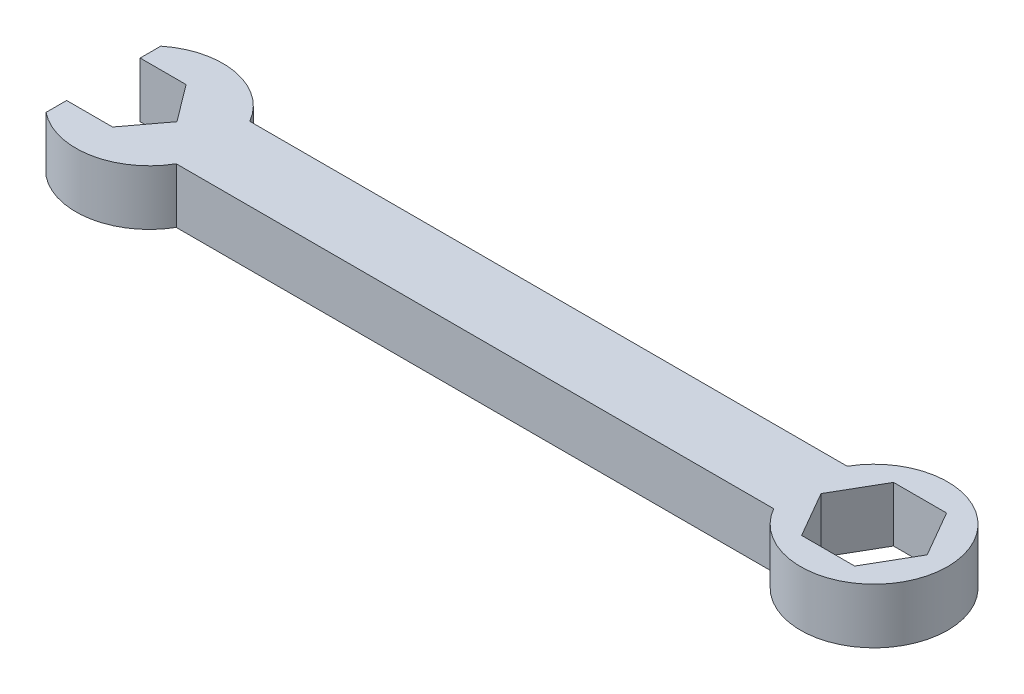
ISO-10303-21;
HEADER;
FILE_DESCRIPTION(('STEP AP214'),'2;1');
FILE_NAME('part.step','',(''),(''),'','','');
FILE_SCHEMA(('AUTOMOTIVE_DESIGN { 1 0 10303 214 1 1 1 1 }'));
ENDSEC;
DATA;
#1=APPLICATION_CONTEXT('core data for automotive mechanical design processes');
#2=APPLICATION_PROTOCOL_DEFINITION('international standard','automotive_design',2000,#1);
#3=PRODUCT_CONTEXT('',#1,'mechanical');
#4=PRODUCT('Part','Part','',(#3));
#5=PRODUCT_RELATED_PRODUCT_CATEGORY('part','',(#4));
#6=PRODUCT_DEFINITION_FORMATION('','',#4);
#7=PRODUCT_DEFINITION_CONTEXT('part definition',#1,'design');
#8=PRODUCT_DEFINITION('design','',#6,#7);
#9=PRODUCT_DEFINITION_SHAPE('','',#8);
#10=(LENGTH_UNIT() NAMED_UNIT(*) SI_UNIT(.MILLI.,.METRE.));
#11=(NAMED_UNIT(*) PLANE_ANGLE_UNIT() SI_UNIT($,.RADIAN.));
#12=(NAMED_UNIT(*) SI_UNIT($,.STERADIAN.) SOLID_ANGLE_UNIT());
#13=UNCERTAINTY_MEASURE_WITH_UNIT(LENGTH_MEASURE(1.E-05),#10,'distance_accuracy_value','');
#14=(GEOMETRIC_REPRESENTATION_CONTEXT(3) GLOBAL_UNCERTAINTY_ASSIGNED_CONTEXT((#13)) GLOBAL_UNIT_ASSIGNED_CONTEXT((#10,
#11,#12)) REPRESENTATION_CONTEXT('',''));
#15=CARTESIAN_POINT('',(0.,0.,0.));
#16=DIRECTION('',(0.,0.,1.));
#17=DIRECTION('',(1.,0.,0.));
#18=AXIS2_PLACEMENT_3D('',#15,#16,#17);
#19=CARTESIAN_POINT('',(0.,7.62,-5.08));
#20=DIRECTION('',(0.,0.,-1.));
#21=DIRECTION('',(-1.,0.,0.));
#22=AXIS2_PLACEMENT_3D('',#19,#20,#21);
#23=PLANE('',#22);
#24=DIRECTION('',(1.,0.,0.));
#25=VECTOR('',#24,1.);
#26=CARTESIAN_POINT('',(0.,0.,-5.08));
#27=LINE('',#26,#25);
#28=CARTESIAN_POINT('',(-41.275,0.,-5.08));
#29=VERTEX_POINT('',#28);
#30=CARTESIAN_POINT('',(41.275,0.,-5.08));
#31=VERTEX_POINT('',#30);
#32=EDGE_CURVE('E283',#29,#31,#27,.T.);
#33=ORIENTED_EDGE('',*,*,#32,.F.);
#34=DIRECTION('',(0.,-1.,0.));
#35=VECTOR('',#34,1.);
#36=CARTESIAN_POINT('',(-41.275,7.62,-5.08));
#37=LINE('',#36,#35);
#38=CARTESIAN_POINT('',(-41.275,7.62,-5.08));
#39=VERTEX_POINT('',#38);
#40=EDGE_CURVE('E11',#39,#29,#37,.T.);
#41=ORIENTED_EDGE('',*,*,#40,.F.);
#42=DIRECTION('',(1.,0.,0.));
#43=VECTOR('',#42,1.);
#44=CARTESIAN_POINT('',(0.,7.62,-5.08));
#45=LINE('',#44,#43);
#46=CARTESIAN_POINT('',(41.275,7.62,-5.08));
#47=VERTEX_POINT('',#46);
#48=EDGE_CURVE('E335',#39,#47,#45,.T.);
#49=ORIENTED_EDGE('',*,*,#48,.T.);
#50=DIRECTION('',(0.,-1.,0.));
#51=VECTOR('',#50,1.);
#52=CARTESIAN_POINT('',(41.275,7.62,-5.08));
#53=LINE('',#52,#51);
#54=EDGE_CURVE('E126',#47,#31,#53,.T.);
#55=ORIENTED_EDGE('',*,*,#54,.T.);
#56=EDGE_LOOP('',(#33,#41,#49,#55));
#57=FACE_BOUND('',#56,.T.);
#58=ADVANCED_FACE('F45',(#57),#23,.T.);
#59=CARTESIAN_POINT('',(-50.0738181024499,7.62,0.));
#60=DIRECTION('',(0.,-1.,0.));
#61=DIRECTION('',(0.,0.,-1.));
#62=AXIS2_PLACEMENT_3D('',#59,#60,#61);
#63=CYLINDRICAL_SURFACE('',#62,10.16);
#64=CARTESIAN_POINT('',(-50.0738181024499,0.,0.));
#65=DIRECTION('',(0.,1.,0.));
#66=DIRECTION('',(0.,0.,1.));
#67=AXIS2_PLACEMENT_3D('',#64,#65,#66);
#68=CIRCLE('',#67,10.16);
#69=CARTESIAN_POINT('',(-56.4238181024499,0.,-7.93114745796597));
#70=VERTEX_POINT('',#69);
#71=EDGE_CURVE('E279',#29,#70,#68,.T.);
#72=ORIENTED_EDGE('',*,*,#71,.T.);
#73=DIRECTION('',(0.,-1.,0.));
#74=VECTOR('',#73,1.);
#75=CARTESIAN_POINT('',(-56.4238181024499,7.62,-7.93114745796597));
#76=LINE('',#75,#74);
#77=CARTESIAN_POINT('',(-56.4238181024499,7.62,-7.93114745796597));
#78=VERTEX_POINT('',#77);
#79=EDGE_CURVE('E56',#78,#70,#76,.T.);
#80=ORIENTED_EDGE('',*,*,#79,.F.);
#81=CARTESIAN_POINT('',(-50.0738181024499,7.62,0.));
#82=DIRECTION('',(0.,1.,0.));
#83=DIRECTION('',(0.,0.,1.));
#84=AXIS2_PLACEMENT_3D('',#81,#82,#83);
#85=CIRCLE('',#84,10.16);
#86=EDGE_CURVE('E332',#39,#78,#85,.T.);
#87=ORIENTED_EDGE('',*,*,#86,.F.);
#88=ORIENTED_EDGE('',*,*,#40,.T.);
#89=EDGE_LOOP('',(#72,#80,#87,#88));
#90=FACE_BOUND('',#89,.T.);
#91=ADVANCED_FACE('F386',(#90),#63,.T.);
#92=CARTESIAN_POINT('',(-56.4238181024499,7.62,0.));
#93=DIRECTION('',(-1.,0.,0.));
#94=DIRECTION('',(0.,0.,1.));
#95=AXIS2_PLACEMENT_3D('',#92,#93,#94);
#96=PLANE('',#95);
#97=DIRECTION('',(0.,0.,-1.));
#98=VECTOR('',#97,1.);
#99=CARTESIAN_POINT('',(-56.4238181024499,0.,0.));
#100=LINE('',#99,#98);
#101=CARTESIAN_POINT('',(-56.4238181024499,0.,-5.08));
#102=VERTEX_POINT('',#101);
#103=EDGE_CURVE('E275',#102,#70,#100,.T.);
#104=ORIENTED_EDGE('',*,*,#103,.F.);
#105=DIRECTION('',(0.,-1.,0.));
#106=VECTOR('',#105,1.);
#107=CARTESIAN_POINT('',(-56.4238181024499,7.62,-5.08));
#108=LINE('',#107,#106);
#109=CARTESIAN_POINT('',(-56.4238181024499,7.62,-5.08));
#110=VERTEX_POINT('',#109);
#111=EDGE_CURVE('E220',#110,#102,#108,.T.);
#112=ORIENTED_EDGE('',*,*,#111,.F.);
#113=DIRECTION('',(0.,0.,-1.));
#114=VECTOR('',#113,1.);
#115=CARTESIAN_POINT('',(-56.4238181024499,7.62,0.));
#116=LINE('',#115,#114);
#117=EDGE_CURVE('E328',#110,#78,#116,.T.);
#118=ORIENTED_EDGE('',*,*,#117,.T.);
#119=ORIENTED_EDGE('',*,*,#79,.T.);
#120=EDGE_LOOP('',(#104,#112,#118,#119));
#121=FACE_BOUND('',#120,.T.);
#122=ADVANCED_FACE('F391',(#121),#96,.T.);
#123=CARTESIAN_POINT('',(0.,7.62,-5.08));
#124=DIRECTION('',(0.,0.,-1.));
#125=DIRECTION('',(-1.,0.,0.));
#126=AXIS2_PLACEMENT_3D('',#123,#124,#125);
#127=PLANE('',#126);
#128=DIRECTION('',(1.,0.,0.));
#129=VECTOR('',#128,1.);
#130=CARTESIAN_POINT('',(0.,0.,-5.08));
#131=LINE('',#130,#129);
#132=CARTESIAN_POINT('',(-50.0738181024499,0.,-5.08));
#133=VERTEX_POINT('',#132);
#134=EDGE_CURVE('E271',#102,#133,#131,.T.);
#135=ORIENTED_EDGE('',*,*,#134,.T.);
#136=DIRECTION('',(0.,-1.,0.));
#137=VECTOR('',#136,1.);
#138=CARTESIAN_POINT('',(-50.0738181024499,7.62,-5.08));
#139=LINE('',#138,#137);
#140=CARTESIAN_POINT('',(-50.0738181024499,7.62,-5.08));
#141=VERTEX_POINT('',#140);
#142=EDGE_CURVE('E217',#141,#133,#139,.T.);
#143=ORIENTED_EDGE('',*,*,#142,.F.);
#144=DIRECTION('',(1.,0.,0.));
#145=VECTOR('',#144,1.);
#146=CARTESIAN_POINT('',(0.,7.62,-5.08));
#147=LINE('',#146,#145);
#148=EDGE_CURVE('E325',#110,#141,#147,.T.);
#149=ORIENTED_EDGE('',*,*,#148,.F.);
#150=ORIENTED_EDGE('',*,*,#111,.T.);
#151=EDGE_LOOP('',(#135,#143,#149,#150));
#152=FACE_BOUND('',#151,.T.);
#153=ADVANCED_FACE('F397',(#152),#127,.F.);
#154=CARTESIAN_POINT('',(-29.6088435855679,7.62,22.206632689176));
#155=DIRECTION('',(-0.8,0.,0.6));
#156=DIRECTION('',(0.6,0.,0.8));
#157=AXIS2_PLACEMENT_3D('',#154,#155,#156);
#158=PLANE('',#157);
#159=DIRECTION('',(-0.6,0.,-0.8));
#160=VECTOR('',#159,1.);
#161=CARTESIAN_POINT('',(-29.6088435855679,0.,22.206632689176));
#162=LINE('',#161,#160);
#163=CARTESIAN_POINT('',(-46.2638181024499,0.,0.));
#164=VERTEX_POINT('',#163);
#165=EDGE_CURVE('E267',#164,#133,#162,.T.);
#166=ORIENTED_EDGE('',*,*,#165,.F.);
#167=DIRECTION('',(0.,-1.,0.));
#168=VECTOR('',#167,1.);
#169=CARTESIAN_POINT('',(-46.2638181024499,7.62,0.));
#170=LINE('',#169,#168);
#171=CARTESIAN_POINT('',(-46.2638181024499,7.62,0.));
#172=VERTEX_POINT('',#171);
#173=EDGE_CURVE('E214',#172,#164,#170,.T.);
#174=ORIENTED_EDGE('',*,*,#173,.F.);
#175=DIRECTION('',(-0.6,0.,-0.8));
#176=VECTOR('',#175,1.);
#177=CARTESIAN_POINT('',(-29.6088435855679,7.62,22.206632689176));
#178=LINE('',#177,#176);
#179=EDGE_CURVE('E321',#172,#141,#178,.T.);
#180=ORIENTED_EDGE('',*,*,#179,.T.);
#181=ORIENTED_EDGE('',*,*,#142,.T.);
#182=EDGE_LOOP('',(#166,#174,#180,#181));
#183=FACE_BOUND('',#182,.T.);
#184=ADVANCED_FACE('F401',(#183),#158,.T.);
#185=CARTESIAN_POINT('',(-29.6088435855679,7.62,-22.206632689176));
#186=DIRECTION('',(0.8,0.,0.6));
#187=DIRECTION('',(0.6,0.,-0.8));
#188=AXIS2_PLACEMENT_3D('',#185,#186,#187);
#189=PLANE('',#188);
#190=DIRECTION('',(-0.6,0.,0.8));
#191=VECTOR('',#190,1.);
#192=CARTESIAN_POINT('',(-29.6088435855679,0.,-22.206632689176));
#193=LINE('',#192,#191);
#194=CARTESIAN_POINT('',(-50.0738181024499,0.,5.08));
#195=VERTEX_POINT('',#194);
#196=EDGE_CURVE('E263',#164,#195,#193,.T.);
#197=ORIENTED_EDGE('',*,*,#196,.T.);
#198=DIRECTION('',(0.,-1.,0.));
#199=VECTOR('',#198,1.);
#200=CARTESIAN_POINT('',(-50.0738181024499,7.62,5.08));
#201=LINE('',#200,#199);
#202=CARTESIAN_POINT('',(-50.0738181024499,7.62,5.08));
#203=VERTEX_POINT('',#202);
#204=EDGE_CURVE('E211',#203,#195,#201,.T.);
#205=ORIENTED_EDGE('',*,*,#204,.F.);
#206=DIRECTION('',(-0.6,0.,0.8));
#207=VECTOR('',#206,1.);
#208=CARTESIAN_POINT('',(-29.6088435855679,7.62,-22.206632689176));
#209=LINE('',#208,#207);
#210=EDGE_CURVE('E318',#172,#203,#209,.T.);
#211=ORIENTED_EDGE('',*,*,#210,.F.);
#212=ORIENTED_EDGE('',*,*,#173,.T.);
#213=EDGE_LOOP('',(#197,#205,#211,#212));
#214=FACE_BOUND('',#213,.T.);
#215=ADVANCED_FACE('F405',(#214),#189,.F.);
#216=CARTESIAN_POINT('',(0.,7.62,5.08));
#217=DIRECTION('',(0.,0.,-1.));
#218=DIRECTION('',(-1.,0.,0.));
#219=AXIS2_PLACEMENT_3D('',#216,#217,#218);
#220=PLANE('',#219);
#221=DIRECTION('',(1.,0.,0.));
#222=VECTOR('',#221,1.);
#223=CARTESIAN_POINT('',(0.,0.,5.08));
#224=LINE('',#223,#222);
#225=CARTESIAN_POINT('',(-56.4238181024499,0.,5.08));
#226=VERTEX_POINT('',#225);
#227=EDGE_CURVE('E259',#226,#195,#224,.T.);
#228=ORIENTED_EDGE('',*,*,#227,.F.);
#229=DIRECTION('',(0.,-1.,0.));
#230=VECTOR('',#229,1.);
#231=CARTESIAN_POINT('',(-56.4238181024499,7.62,5.08));
#232=LINE('',#231,#230);
#233=CARTESIAN_POINT('',(-56.4238181024499,7.62,5.08));
#234=VERTEX_POINT('',#233);
#235=EDGE_CURVE('E204',#234,#226,#232,.T.);
#236=ORIENTED_EDGE('',*,*,#235,.F.);
#237=DIRECTION('',(1.,0.,0.));
#238=VECTOR('',#237,1.);
#239=CARTESIAN_POINT('',(0.,7.62,5.08));
#240=LINE('',#239,#238);
#241=EDGE_CURVE('E314',#234,#203,#240,.T.);
#242=ORIENTED_EDGE('',*,*,#241,.T.);
#243=ORIENTED_EDGE('',*,*,#204,.T.);
#244=EDGE_LOOP('',(#228,#236,#242,#243));
#245=FACE_BOUND('',#244,.T.);
#246=ADVANCED_FACE('F409',(#245),#220,.T.);
#247=CARTESIAN_POINT('',(-56.4238181024499,7.62,0.));
#248=DIRECTION('',(1.,0.,0.));
#249=DIRECTION('',(0.,0.,-1.));
#250=AXIS2_PLACEMENT_3D('',#247,#248,#249);
#251=PLANE('',#250);
#252=DIRECTION('',(0.,0.,1.));
#253=VECTOR('',#252,1.);
#254=CARTESIAN_POINT('',(-56.4238181024499,0.,0.));
#255=LINE('',#254,#253);
#256=CARTESIAN_POINT('',(-56.4238181024499,0.,7.93114745796597));
#257=VERTEX_POINT('',#256);
#258=EDGE_CURVE('E255',#226,#257,#255,.T.);
#259=ORIENTED_EDGE('',*,*,#258,.T.);
#260=DIRECTION('',(0.,-1.,0.));
#261=VECTOR('',#260,1.);
#262=CARTESIAN_POINT('',(-56.4238181024499,7.62,7.93114745796597));
#263=LINE('',#262,#261);
#264=CARTESIAN_POINT('',(-56.4238181024499,7.62,7.93114745796597));
#265=VERTEX_POINT('',#264);
#266=EDGE_CURVE('E200',#265,#257,#263,.T.);
#267=ORIENTED_EDGE('',*,*,#266,.F.);
#268=DIRECTION('',(0.,0.,1.));
#269=VECTOR('',#268,1.);
#270=CARTESIAN_POINT('',(-56.4238181024499,7.62,0.));
#271=LINE('',#270,#269);
#272=EDGE_CURVE('E191',#234,#265,#271,.T.);
#273=ORIENTED_EDGE('',*,*,#272,.F.);
#274=ORIENTED_EDGE('',*,*,#235,.T.);
#275=EDGE_LOOP('',(#259,#267,#273,#274));
#276=FACE_BOUND('',#275,.T.);
#277=ADVANCED_FACE('F413',(#276),#251,.F.);
#278=CARTESIAN_POINT('',(-50.0738181024499,7.62,0.));
#279=DIRECTION('',(0.,-1.,0.));
#280=DIRECTION('',(0.,0.,-1.));
#281=AXIS2_PLACEMENT_3D('',#278,#279,#280);
#282=CYLINDRICAL_SURFACE('',#281,10.16);
#283=CARTESIAN_POINT('',(-50.0738181024499,0.,0.));
#284=DIRECTION('',(0.,1.,0.));
#285=DIRECTION('',(0.,0.,1.));
#286=AXIS2_PLACEMENT_3D('',#283,#284,#285);
#287=CIRCLE('',#286,10.16);
#288=CARTESIAN_POINT('',(-41.275,0.,5.08));
#289=VERTEX_POINT('',#288);
#290=EDGE_CURVE('E198',#257,#289,#287,.T.);
#291=ORIENTED_EDGE('',*,*,#290,.T.);
#292=DIRECTION('',(0.,-1.,0.));
#293=VECTOR('',#292,1.);
#294=CARTESIAN_POINT('',(-41.275,7.62,5.08));
#295=LINE('',#294,#293);
#296=CARTESIAN_POINT('',(-41.275,7.62,5.08));
#297=VERTEX_POINT('',#296);
#298=EDGE_CURVE('E181',#297,#289,#295,.T.);
#299=ORIENTED_EDGE('',*,*,#298,.F.);
#300=CARTESIAN_POINT('',(-50.0738181024499,7.62,0.));
#301=DIRECTION('',(0.,1.,0.));
#302=DIRECTION('',(0.,0.,1.));
#303=AXIS2_PLACEMENT_3D('',#300,#301,#302);
#304=CIRCLE('',#303,10.16);
#305=EDGE_CURVE('E185',#265,#297,#304,.T.);
#306=ORIENTED_EDGE('',*,*,#305,.F.);
#307=ORIENTED_EDGE('',*,*,#266,.T.);
#308=EDGE_LOOP('',(#291,#299,#306,#307));
#309=FACE_BOUND('',#308,.T.);
#310=ADVANCED_FACE('F197',(#309),#282,.T.);
#311=CARTESIAN_POINT('',(0.,7.62,5.08));
#312=DIRECTION('',(0.,0.,-1.));
#313=DIRECTION('',(-1.,0.,0.));
#314=AXIS2_PLACEMENT_3D('',#311,#312,#313);
#315=PLANE('',#314);
#316=DIRECTION('',(1.,0.,0.));
#317=VECTOR('',#316,1.);
#318=CARTESIAN_POINT('',(0.,0.,5.08));
#319=LINE('',#318,#317);
#320=CARTESIAN_POINT('',(41.275,0.,5.08));
#321=VERTEX_POINT('',#320);
#322=EDGE_CURVE('E250',#289,#321,#319,.T.);
#323=ORIENTED_EDGE('',*,*,#322,.T.);
#324=DIRECTION('',(0.,-1.,0.));
#325=VECTOR('',#324,1.);
#326=CARTESIAN_POINT('',(41.275,7.62,5.08));
#327=LINE('',#326,#325);
#328=CARTESIAN_POINT('',(41.275,7.62,5.08));
#329=VERTEX_POINT('',#328);
#330=EDGE_CURVE('E183',#329,#321,#327,.T.);
#331=ORIENTED_EDGE('',*,*,#330,.F.);
#332=DIRECTION('',(1.,0.,0.));
#333=VECTOR('',#332,1.);
#334=CARTESIAN_POINT('',(0.,7.62,5.08));
#335=LINE('',#334,#333);
#336=EDGE_CURVE('E176',#297,#329,#335,.T.);
#337=ORIENTED_EDGE('',*,*,#336,.F.);
#338=ORIENTED_EDGE('',*,*,#298,.T.);
#339=EDGE_LOOP('',(#323,#331,#337,#338));
#340=FACE_BOUND('',#339,.T.);
#341=ADVANCED_FACE('F179',(#340),#315,.F.);
#342=CARTESIAN_POINT('',(43.0546248908686,7.62,24.8575992706014));
#343=DIRECTION('',(-0.866025403784439,0.,-0.5));
#344=DIRECTION('',(-0.5,0.,0.866025403784439));
#345=AXIS2_PLACEMENT_3D('',#342,#343,#344);
#346=PLANE('',#345);
#347=DIRECTION('',(0.5,0.,-0.866025403784439));
#348=VECTOR('',#347,1.);
#349=CARTESIAN_POINT('',(43.0546248908686,0.,24.8575992706014));
#350=LINE('',#349,#348);
#351=CARTESIAN_POINT('',(53.739992311804,0.,6.34999999999999));
#352=VERTEX_POINT('',#351);
#353=CARTESIAN_POINT('',(57.4061665211582,0.,0.));
#354=VERTEX_POINT('',#353);
#355=EDGE_CURVE('E306',#352,#354,#350,.T.);
#356=ORIENTED_EDGE('',*,*,#355,.F.);
#357=DIRECTION('',(0.,-1.,0.));
#358=VECTOR('',#357,1.);
#359=CARTESIAN_POINT('',(53.739992311804,7.62,6.34999999999999));
#360=LINE('',#359,#358);
#361=CARTESIAN_POINT('',(53.739992311804,7.62,6.34999999999999));
#362=VERTEX_POINT('',#361);
#363=EDGE_CURVE('E49',#362,#352,#360,.T.);
#364=ORIENTED_EDGE('',*,*,#363,.F.);
#365=DIRECTION('',(0.5,0.,-0.866025403784439));
#366=VECTOR('',#365,1.);
#367=CARTESIAN_POINT('',(43.0546248908686,7.62,24.8575992706014));
#368=LINE('',#367,#366);
#369=CARTESIAN_POINT('',(57.4061665211582,7.62,0.));
#370=VERTEX_POINT('',#369);
#371=EDGE_CURVE('E249',#362,#370,#368,.T.);
#372=ORIENTED_EDGE('',*,*,#371,.T.);
#373=DIRECTION('',(0.,-1.,0.));
#374=VECTOR('',#373,1.);
#375=CARTESIAN_POINT('',(57.4061665211582,7.62,0.));
#376=LINE('',#375,#374);
#377=EDGE_CURVE('E225',#370,#354,#376,.T.);
#378=ORIENTED_EDGE('',*,*,#377,.T.);
#379=EDGE_LOOP('',(#356,#364,#372,#378));
#380=FACE_BOUND('',#379,.T.);
#381=ADVANCED_FACE('F47',(#380),#346,.T.);
#382=CARTESIAN_POINT('',(0.,7.62,6.35));
#383=DIRECTION('',(0.,0.,-1.));
#384=DIRECTION('',(-1.,0.,0.));
#385=AXIS2_PLACEMENT_3D('',#382,#383,#384);
#386=PLANE('',#385);
#387=DIRECTION('',(1.,0.,0.));
#388=VECTOR('',#387,1.);
#389=CARTESIAN_POINT('',(0.,0.,6.35));
#390=LINE('',#389,#388);
#391=CARTESIAN_POINT('',(46.4076438930958,0.,6.34999999999999));
#392=VERTEX_POINT('',#391);
#393=EDGE_CURVE('E302',#392,#352,#390,.T.);
#394=ORIENTED_EDGE('',*,*,#393,.F.);
#395=DIRECTION('',(0.,-1.,0.));
#396=VECTOR('',#395,1.);
#397=CARTESIAN_POINT('',(46.4076438930958,7.62,6.34999999999999));
#398=LINE('',#397,#396);
#399=CARTESIAN_POINT('',(46.4076438930958,7.62,6.34999999999999));
#400=VERTEX_POINT('',#399);
#401=EDGE_CURVE('E236',#400,#392,#398,.T.);
#402=ORIENTED_EDGE('',*,*,#401,.F.);
#403=DIRECTION('',(1.,0.,0.));
#404=VECTOR('',#403,1.);
#405=CARTESIAN_POINT('',(0.,7.62,6.35));
#406=LINE('',#405,#404);
#407=EDGE_CURVE('E353',#400,#362,#406,.T.);
#408=ORIENTED_EDGE('',*,*,#407,.T.);
#409=ORIENTED_EDGE('',*,*,#363,.T.);
#410=EDGE_LOOP('',(#394,#402,#408,#409));
#411=FACE_BOUND('',#410,.T.);
#412=ADVANCED_FACE('F368',(#411),#386,.T.);
#413=CARTESIAN_POINT('',(32.0561022628063,7.62,-18.5075992706013));
#414=DIRECTION('',(0.866025403784439,0.,-0.5));
#415=DIRECTION('',(-0.5,0.,-0.866025403784439));
#416=AXIS2_PLACEMENT_3D('',#413,#414,#415);
#417=PLANE('',#416);
#418=DIRECTION('',(0.5,0.,0.866025403784439));
#419=VECTOR('',#418,1.);
#420=CARTESIAN_POINT('',(32.0561022628063,0.,-18.5075992706013));
#421=LINE('',#420,#419);
#422=CARTESIAN_POINT('',(42.7414696837416,0.,0.));
#423=VERTEX_POINT('',#422);
#424=EDGE_CURVE('E298',#423,#392,#421,.T.);
#425=ORIENTED_EDGE('',*,*,#424,.F.);
#426=DIRECTION('',(0.,-1.,0.));
#427=VECTOR('',#426,1.);
#428=CARTESIAN_POINT('',(42.7414696837416,7.62,0.));
#429=LINE('',#428,#427);
#430=CARTESIAN_POINT('',(42.7414696837416,7.62,0.));
#431=VERTEX_POINT('',#430);
#432=EDGE_CURVE('E234',#431,#423,#429,.T.);
#433=ORIENTED_EDGE('',*,*,#432,.F.);
#434=DIRECTION('',(0.5,0.,0.866025403784439));
#435=VECTOR('',#434,1.);
#436=CARTESIAN_POINT('',(32.0561022628063,7.62,-18.5075992706013));
#437=LINE('',#436,#435);
#438=EDGE_CURVE('E350',#431,#400,#437,.T.);
#439=ORIENTED_EDGE('',*,*,#438,.T.);
#440=ORIENTED_EDGE('',*,*,#401,.T.);
#441=EDGE_LOOP('',(#425,#433,#439,#440));
#442=FACE_BOUND('',#441,.T.);
#443=ADVANCED_FACE('F370',(#442),#417,.T.);
#444=CARTESIAN_POINT('',(32.0561022628062,7.62,18.5075992706014));
#445=DIRECTION('',(0.866025403784439,0.,0.5));
#446=DIRECTION('',(0.5,0.,-0.866025403784439));
#447=AXIS2_PLACEMENT_3D('',#444,#445,#446);
#448=PLANE('',#447);
#449=DIRECTION('',(-0.5,0.,0.866025403784439));
#450=VECTOR('',#449,1.);
#451=CARTESIAN_POINT('',(32.0561022628062,0.,18.5075992706014));
#452=LINE('',#451,#450);
#453=CARTESIAN_POINT('',(46.4076438930958,0.,-6.35000000000001));
#454=VERTEX_POINT('',#453);
#455=EDGE_CURVE('E294',#454,#423,#452,.T.);
#456=ORIENTED_EDGE('',*,*,#455,.F.);
#457=DIRECTION('',(0.,-1.,0.));
#458=VECTOR('',#457,1.);
#459=CARTESIAN_POINT('',(46.4076438930958,7.62,-6.35000000000001));
#460=LINE('',#459,#458);
#461=CARTESIAN_POINT('',(46.4076438930958,7.62,-6.35000000000001));
#462=VERTEX_POINT('',#461);
#463=EDGE_CURVE('E231',#462,#454,#460,.T.);
#464=ORIENTED_EDGE('',*,*,#463,.F.);
#465=DIRECTION('',(-0.5,0.,0.866025403784439));
#466=VECTOR('',#465,1.);
#467=CARTESIAN_POINT('',(32.0561022628062,7.62,18.5075992706014));
#468=LINE('',#467,#466);
#469=EDGE_CURVE('E346',#462,#431,#468,.T.);
#470=ORIENTED_EDGE('',*,*,#469,.T.);
#471=ORIENTED_EDGE('',*,*,#432,.T.);
#472=EDGE_LOOP('',(#456,#464,#470,#471));
#473=FACE_BOUND('',#472,.T.);
#474=ADVANCED_FACE('F373',(#473),#448,.T.);
#475=CARTESIAN_POINT('',(0.,7.62,-6.35));
#476=DIRECTION('',(0.,0.,1.));
#477=DIRECTION('',(1.,0.,0.));
#478=AXIS2_PLACEMENT_3D('',#475,#476,#477);
#479=PLANE('',#478);
#480=DIRECTION('',(-1.,0.,0.));
#481=VECTOR('',#480,1.);
#482=CARTESIAN_POINT('',(0.,0.,-6.35));
#483=LINE('',#482,#481);
#484=CARTESIAN_POINT('',(53.739992311804,0.,-6.35));
#485=VERTEX_POINT('',#484);
#486=EDGE_CURVE('E290',#485,#454,#483,.T.);
#487=ORIENTED_EDGE('',*,*,#486,.F.);
#488=DIRECTION('',(0.,-1.,0.));
#489=VECTOR('',#488,1.);
#490=CARTESIAN_POINT('',(53.739992311804,7.62,-6.35));
#491=LINE('',#490,#489);
#492=CARTESIAN_POINT('',(53.739992311804,7.62,-6.35));
#493=VERTEX_POINT('',#492);
#494=EDGE_CURVE('E228',#493,#485,#491,.T.);
#495=ORIENTED_EDGE('',*,*,#494,.F.);
#496=DIRECTION('',(-1.,0.,0.));
#497=VECTOR('',#496,1.);
#498=CARTESIAN_POINT('',(0.,7.62,-6.35));
#499=LINE('',#498,#497);
#500=EDGE_CURVE('E342',#493,#462,#499,.T.);
#501=ORIENTED_EDGE('',*,*,#500,.T.);
#502=ORIENTED_EDGE('',*,*,#463,.T.);
#503=EDGE_LOOP('',(#487,#495,#501,#502));
#504=FACE_BOUND('',#503,.T.);
#505=ADVANCED_FACE('F375',(#504),#479,.T.);
#506=CARTESIAN_POINT('',(43.0546248908686,7.62,-24.8575992706013));
#507=DIRECTION('',(-0.866025403784439,0.,0.5));
#508=DIRECTION('',(0.5,0.,0.866025403784439));
#509=AXIS2_PLACEMENT_3D('',#506,#507,#508);
#510=PLANE('',#509);
#511=DIRECTION('',(-0.5,0.,-0.866025403784439));
#512=VECTOR('',#511,1.);
#513=CARTESIAN_POINT('',(43.0546248908686,0.,-24.8575992706013));
#514=LINE('',#513,#512);
#515=EDGE_CURVE('E286',#354,#485,#514,.T.);
#516=ORIENTED_EDGE('',*,*,#515,.F.);
#517=ORIENTED_EDGE('',*,*,#377,.F.);
#518=DIRECTION('',(-0.5,0.,-0.866025403784439));
#519=VECTOR('',#518,1.);
#520=CARTESIAN_POINT('',(43.0546248908686,7.62,-24.8575992706013));
#521=LINE('',#520,#519);
#522=EDGE_CURVE('E338',#370,#493,#521,.T.);
#523=ORIENTED_EDGE('',*,*,#522,.T.);
#524=ORIENTED_EDGE('',*,*,#494,.T.);
#525=EDGE_LOOP('',(#516,#517,#523,#524));
#526=FACE_BOUND('',#525,.T.);
#527=ADVANCED_FACE('F364',(#526),#510,.T.);
#528=CARTESIAN_POINT('',(50.0738181024499,7.62,0.));
#529=DIRECTION('',(0.,-1.,0.));
#530=DIRECTION('',(0.,0.,-1.));
#531=AXIS2_PLACEMENT_3D('',#528,#529,#530);
#532=CYLINDRICAL_SURFACE('',#531,10.16);
#533=CARTESIAN_POINT('',(50.0738181024499,0.,0.));
#534=DIRECTION('',(0.,1.,0.));
#535=DIRECTION('',(0.,0.,1.));
#536=AXIS2_PLACEMENT_3D('',#533,#534,#535);
#537=CIRCLE('',#536,10.16);
#538=EDGE_CURVE('E119',#321,#31,#537,.T.);
#539=ORIENTED_EDGE('',*,*,#538,.T.);
#540=ORIENTED_EDGE('',*,*,#54,.F.);
#541=CARTESIAN_POINT('',(50.0738181024499,7.62,0.));
#542=DIRECTION('',(0.,1.,0.));
#543=DIRECTION('',(0.,0.,1.));
#544=AXIS2_PLACEMENT_3D('',#541,#542,#543);
#545=CIRCLE('',#544,10.16);
#546=EDGE_CURVE('E65',#329,#47,#545,.T.);
#547=ORIENTED_EDGE('',*,*,#546,.F.);
#548=ORIENTED_EDGE('',*,*,#330,.T.);
#549=EDGE_LOOP('',(#539,#540,#547,#548));
#550=FACE_BOUND('',#549,.T.);
#551=ADVANCED_FACE('F382',(#550),#532,.T.);
#552=CARTESIAN_POINT('',(0.,7.62,0.));
#553=DIRECTION('',(0.,1.,0.));
#554=DIRECTION('',(0.,0.,1.));
#555=AXIS2_PLACEMENT_3D('',#552,#553,#554);
#556=PLANE('',#555);
#557=ORIENTED_EDGE('',*,*,#371,.F.);
#558=ORIENTED_EDGE('',*,*,#407,.F.);
#559=ORIENTED_EDGE('',*,*,#438,.F.);
#560=ORIENTED_EDGE('',*,*,#469,.F.);
#561=ORIENTED_EDGE('',*,*,#500,.F.);
#562=ORIENTED_EDGE('',*,*,#522,.F.);
#563=EDGE_LOOP('',(#557,#558,#559,#560,#561,#562));
#564=FACE_BOUND('',#563,.T.);
#565=ORIENTED_EDGE('',*,*,#48,.F.);
#566=ORIENTED_EDGE('',*,*,#86,.T.);
#567=ORIENTED_EDGE('',*,*,#117,.F.);
#568=ORIENTED_EDGE('',*,*,#148,.T.);
#569=ORIENTED_EDGE('',*,*,#179,.F.);
#570=ORIENTED_EDGE('',*,*,#210,.T.);
#571=ORIENTED_EDGE('',*,*,#241,.F.);
#572=ORIENTED_EDGE('',*,*,#272,.T.);
#573=ORIENTED_EDGE('',*,*,#305,.T.);
#574=ORIENTED_EDGE('',*,*,#336,.T.);
#575=ORIENTED_EDGE('',*,*,#546,.T.);
#576=EDGE_LOOP('',(#565,#566,#567,#568,#569,#570,#571,#572,#573,#574,#575));
#577=FACE_BOUND('',#576,.T.);
#578=ADVANCED_FACE('F188',(#564,#577),#556,.T.);
#579=CARTESIAN_POINT('',(0.,0.,0.));
#580=DIRECTION('',(0.,1.,0.));
#581=DIRECTION('',(0.,0.,1.));
#582=AXIS2_PLACEMENT_3D('',#579,#580,#581);
#583=PLANE('',#582);
#584=ORIENTED_EDGE('',*,*,#355,.T.);
#585=ORIENTED_EDGE('',*,*,#515,.T.);
#586=ORIENTED_EDGE('',*,*,#486,.T.);
#587=ORIENTED_EDGE('',*,*,#455,.T.);
#588=ORIENTED_EDGE('',*,*,#424,.T.);
#589=ORIENTED_EDGE('',*,*,#393,.T.);
#590=EDGE_LOOP('',(#584,#585,#586,#587,#588,#589));
#591=FACE_BOUND('',#590,.T.);
#592=ORIENTED_EDGE('',*,*,#32,.T.);
#593=ORIENTED_EDGE('',*,*,#538,.F.);
#594=ORIENTED_EDGE('',*,*,#322,.F.);
#595=ORIENTED_EDGE('',*,*,#290,.F.);
#596=ORIENTED_EDGE('',*,*,#258,.F.);
#597=ORIENTED_EDGE('',*,*,#227,.T.);
#598=ORIENTED_EDGE('',*,*,#196,.F.);
#599=ORIENTED_EDGE('',*,*,#165,.T.);
#600=ORIENTED_EDGE('',*,*,#134,.F.);
#601=ORIENTED_EDGE('',*,*,#103,.T.);
#602=ORIENTED_EDGE('',*,*,#71,.F.);
#603=EDGE_LOOP('',(#592,#593,#594,#595,#596,#597,#598,#599,#600,#601,#602));
#604=FACE_BOUND('',#603,.T.);
#605=ADVANCED_FACE('F367',(#591,#604),#583,.F.);
#606=CLOSED_SHELL('',(#58,#91,#122,#153,#184,#215,#246,#277,#310,#341,#381,#412,#443,#474,#505,
#527,#551,#578,#605));
#607=MANIFOLD_SOLID_BREP('B2',#606);
#608=ADVANCED_BREP_SHAPE_REPRESENTATION('',(#18,#607),#14);
#609=SHAPE_DEFINITION_REPRESENTATION(#9,#608);
ENDSEC;
END-ISO-10303-21;
